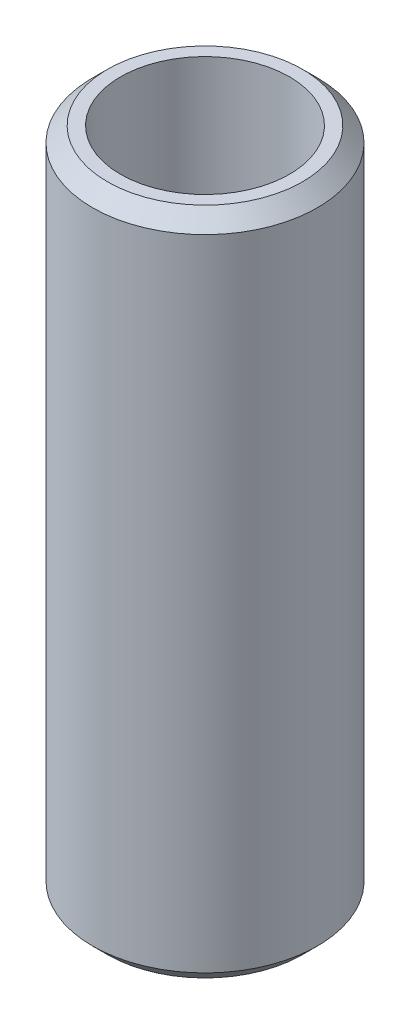
ISO-10303-21;
HEADER;
FILE_DESCRIPTION(('STEP AP214'),'2;1');
FILE_NAME('part.step','',(''),(''),'','','');
FILE_SCHEMA(('AUTOMOTIVE_DESIGN { 1 0 10303 214 1 1 1 1 }'));
ENDSEC;
DATA;
#1=APPLICATION_CONTEXT('core data for automotive mechanical design processes');
#2=APPLICATION_PROTOCOL_DEFINITION('international standard','automotive_design',2000,#1);
#3=PRODUCT_CONTEXT('',#1,'mechanical');
#4=PRODUCT('Part','Part','',(#3));
#5=PRODUCT_RELATED_PRODUCT_CATEGORY('part','',(#4));
#6=PRODUCT_DEFINITION_FORMATION('','',#4);
#7=PRODUCT_DEFINITION_CONTEXT('part definition',#1,'design');
#8=PRODUCT_DEFINITION('design','',#6,#7);
#9=PRODUCT_DEFINITION_SHAPE('','',#8);
#10=(LENGTH_UNIT() NAMED_UNIT(*) SI_UNIT(.MILLI.,.METRE.));
#11=(NAMED_UNIT(*) PLANE_ANGLE_UNIT() SI_UNIT($,.RADIAN.));
#12=(NAMED_UNIT(*) SI_UNIT($,.STERADIAN.) SOLID_ANGLE_UNIT());
#13=UNCERTAINTY_MEASURE_WITH_UNIT(LENGTH_MEASURE(1.E-05),#10,'distance_accuracy_value','');
#14=(GEOMETRIC_REPRESENTATION_CONTEXT(3) GLOBAL_UNCERTAINTY_ASSIGNED_CONTEXT((#13)) GLOBAL_UNIT_ASSIGNED_CONTEXT((#10,
#11,#12)) REPRESENTATION_CONTEXT('',''));
#15=CARTESIAN_POINT('',(0.,0.,0.));
#16=DIRECTION('',(0.,0.,1.));
#17=DIRECTION('',(1.,0.,0.));
#18=AXIS2_PLACEMENT_3D('',#15,#16,#17);
#19=CARTESIAN_POINT('',(0.,208.298471464032,0.));
#20=DIRECTION('',(0.,-1.,0.));
#21=DIRECTION('',(0.,0.,-1.));
#22=AXIS2_PLACEMENT_3D('',#19,#20,#21);
#23=CYLINDRICAL_SURFACE('',#22,35.);
#24=CARTESIAN_POINT('',(0.,203.643226573095,0.));
#25=DIRECTION('',(0.,1.,0.));
#26=DIRECTION('',(0.,0.,1.));
#27=AXIS2_PLACEMENT_3D('',#24,#25,#26);
#28=CIRCLE('',#27,35.);
#29=CARTESIAN_POINT('',(0.,203.643226573095,35.));
#30=VERTEX_POINT('',#29);
#31=EDGE_CURVE('E50',#30,#30,#28,.F.);
#32=ORIENTED_EDGE('',*,*,#31,.T.);
#33=EDGE_LOOP('',(#32));
#34=FACE_BOUND('',#33,.T.);
#35=CARTESIAN_POINT('',(0.,4.65524489093683,0.));
#36=DIRECTION('',(0.,1.,0.));
#37=DIRECTION('',(0.,0.,1.));
#38=AXIS2_PLACEMENT_3D('',#35,#36,#37);
#39=CIRCLE('',#38,35.);
#40=CARTESIAN_POINT('',(0.,4.65524489093683,35.));
#41=VERTEX_POINT('',#40);
#42=EDGE_CURVE('E51',#41,#41,#39,.T.);
#43=ORIENTED_EDGE('',*,*,#42,.T.);
#44=EDGE_LOOP('',(#43));
#45=FACE_BOUND('',#44,.T.);
#46=ADVANCED_FACE('F39',(#34,#45),#23,.T.);
#47=CARTESIAN_POINT('',(0.,208.298471464032,0.));
#48=DIRECTION('',(0.,1.,0.));
#49=DIRECTION('',(0.,0.,1.));
#50=AXIS2_PLACEMENT_3D('',#47,#48,#49);
#51=PLANE('',#50);
#52=CARTESIAN_POINT('',(0.,208.298471464032,0.));
#53=DIRECTION('',(0.,1.,0.));
#54=DIRECTION('',(0.,0.,1.));
#55=AXIS2_PLACEMENT_3D('',#52,#53,#54);
#56=CIRCLE('',#55,30.3447551090632);
#57=CARTESIAN_POINT('',(0.,208.298471464032,30.3447551090632));
#58=VERTEX_POINT('',#57);
#59=EDGE_CURVE('E54',#58,#58,#56,.T.);
#60=ORIENTED_EDGE('',*,*,#59,.T.);
#61=EDGE_LOOP('',(#60));
#62=FACE_BOUND('',#61,.T.);
#63=CARTESIAN_POINT('',(0.,208.298471464032,0.));
#64=DIRECTION('',(0.,1.,0.));
#65=DIRECTION('',(0.,0.,1.));
#66=AXIS2_PLACEMENT_3D('',#63,#64,#65);
#67=CIRCLE('',#66,26.2993905384078);
#68=CARTESIAN_POINT('',(0.,208.298471464032,26.2993905384078));
#69=VERTEX_POINT('',#68);
#70=EDGE_CURVE('E58',#69,#69,#67,.T.);
#71=ORIENTED_EDGE('',*,*,#70,.F.);
#72=EDGE_LOOP('',(#71));
#73=FACE_BOUND('',#72,.T.);
#74=ADVANCED_FACE('F69',(#62,#73),#51,.T.);
#75=CARTESIAN_POINT('',(0.,0.,0.));
#76=DIRECTION('',(0.,1.,0.));
#77=DIRECTION('',(0.,0.,1.));
#78=AXIS2_PLACEMENT_3D('',#75,#76,#77);
#79=PLANE('',#78);
#80=CARTESIAN_POINT('',(0.,0.,0.));
#81=DIRECTION('',(0.,1.,0.));
#82=DIRECTION('',(0.,0.,1.));
#83=AXIS2_PLACEMENT_3D('',#80,#81,#82);
#84=CIRCLE('',#83,30.3447551090631);
#85=CARTESIAN_POINT('',(0.,0.,30.3447551090631));
#86=VERTEX_POINT('',#85);
#87=EDGE_CURVE('E10',#86,#86,#84,.F.);
#88=ORIENTED_EDGE('',*,*,#87,.T.);
#89=EDGE_LOOP('',(#88));
#90=FACE_BOUND('',#89,.T.);
#91=CARTESIAN_POINT('',(0.,0.,0.));
#92=DIRECTION('',(0.,1.,0.));
#93=DIRECTION('',(0.,0.,1.));
#94=AXIS2_PLACEMENT_3D('',#91,#92,#93);
#95=CIRCLE('',#94,26.2993905384078);
#96=CARTESIAN_POINT('',(0.,0.,26.2993905384078));
#97=VERTEX_POINT('',#96);
#98=EDGE_CURVE('E63',#97,#97,#95,.T.);
#99=ORIENTED_EDGE('',*,*,#98,.T.);
#100=EDGE_LOOP('',(#99));
#101=FACE_BOUND('',#100,.T.);
#102=ADVANCED_FACE('F75',(#90,#101),#79,.F.);
#103=CARTESIAN_POINT('',(0.,208.298471464032,0.));
#104=DIRECTION('',(0.,-1.,0.));
#105=DIRECTION('',(0.,0.,-1.));
#106=AXIS2_PLACEMENT_3D('',#103,#104,#105);
#107=CYLINDRICAL_SURFACE('',#106,26.2993905384078);
#108=ORIENTED_EDGE('',*,*,#70,.T.);
#109=EDGE_LOOP('',(#108));
#110=FACE_BOUND('',#109,.T.);
#111=ORIENTED_EDGE('',*,*,#98,.F.);
#112=EDGE_LOOP('',(#111));
#113=FACE_BOUND('',#112,.T.);
#114=ADVANCED_FACE('F70',(#110,#113),#107,.F.);
#115=CARTESIAN_POINT('',(0.,208.298471464032,0.));
#116=DIRECTION('',(0.,-1.,0.));
#117=DIRECTION('',(0.,0.,-1.));
#118=AXIS2_PLACEMENT_3D('',#115,#116,#117);
#119=CONICAL_SURFACE('',#118,30.3447551090632,0.785398163397443);
#120=ORIENTED_EDGE('',*,*,#31,.F.);
#121=EDGE_LOOP('',(#120));
#122=FACE_BOUND('',#121,.T.);
#123=ORIENTED_EDGE('',*,*,#59,.F.);
#124=EDGE_LOOP('',(#123));
#125=FACE_BOUND('',#124,.T.);
#126=ADVANCED_FACE('F81',(#122,#125),#119,.T.);
#127=CARTESIAN_POINT('',(0.,4.65524489093683,0.));
#128=DIRECTION('',(0.,1.,0.));
#129=DIRECTION('',(0.,0.,1.));
#130=AXIS2_PLACEMENT_3D('',#127,#128,#129);
#131=CONICAL_SURFACE('',#130,35.,0.785398163397452);
#132=CARTESIAN_POINT('',(0.,0.,30.3447551090631));
#133=CARTESIAN_POINT('',(0.,0.0484921342805907,30.3932472433437));
#134=CARTESIAN_POINT('',(0.,0.0969842685611828,30.4417393776243));
#135=CARTESIAN_POINT('',(0.,0.193968537122367,30.5387236461855));
#136=CARTESIAN_POINT('',(0.,0.242460671402959,30.5872157804661));
#137=CARTESIAN_POINT('',(0.,0.339444939964143,30.6842000490273));
#138=CARTESIAN_POINT('',(0.,0.387937074244735,30.7326921833079));
#139=CARTESIAN_POINT('',(0.,0.484921342805918,30.8296764518691));
#140=CARTESIAN_POINT('',(0.,0.53341347708651,30.8781685861497));
#141=CARTESIAN_POINT('',(0.,0.630397745647695,30.9751528547108));
#142=CARTESIAN_POINT('',(0.,0.678889879928287,31.0236449889914));
#143=CARTESIAN_POINT('',(0.,0.77587414848947,31.1206292575526));
#144=CARTESIAN_POINT('',(0.,0.824366282770061,31.1691213918332));
#145=CARTESIAN_POINT('',(0.,0.921350551331245,31.2661056603944));
#146=CARTESIAN_POINT('',(0.,0.969842685611838,31.314597794675));
#147=CARTESIAN_POINT('',(0.,1.06682695417302,31.4115820632362));
#148=CARTESIAN_POINT('',(0.,1.11531908845361,31.4600741975168));
#149=CARTESIAN_POINT('',(0.,1.2123033570148,31.557058466078));
#150=CARTESIAN_POINT('',(0.,1.26079549129539,31.6055506003586));
#151=CARTESIAN_POINT('',(0.,1.35777975985657,31.7025348689197));
#152=CARTESIAN_POINT('',(0.,1.40627189413717,31.7510270032003));
#153=CARTESIAN_POINT('',(0.,1.50325616269835,31.8480112717615));
#154=CARTESIAN_POINT('',(0.,1.55174829697894,31.8965034060421));
#155=CARTESIAN_POINT('',(0.,1.64873256554012,31.9934876746033));
#156=CARTESIAN_POINT('',(0.,1.69722469982072,32.0419798088839));
#157=CARTESIAN_POINT('',(0.,1.7942089683819,32.1389640774451));
#158=CARTESIAN_POINT('',(0.,1.84270110266249,32.1874562117257));
#159=CARTESIAN_POINT('',(0.,1.93968537122368,32.2844404802868));
#160=CARTESIAN_POINT('',(0.,1.98817750550427,32.3329326145674));
#161=CARTESIAN_POINT('',(0.,2.08516177406545,32.4299168831286));
#162=CARTESIAN_POINT('',(0.,2.13365390834604,32.4784090174092));
#163=CARTESIAN_POINT('',(0.,2.23063817690723,32.5753932859704));
#164=CARTESIAN_POINT('',(0.,2.27913031118782,32.623885420251));
#165=CARTESIAN_POINT('',(0.,2.37611457974901,32.7208696888122));
#166=CARTESIAN_POINT('',(0.,2.4246067140296,32.7693618230928));
#167=CARTESIAN_POINT('',(0.,2.52159098259078,32.8663460916539));
#168=CARTESIAN_POINT('',(0.,2.57008311687137,32.9148382259345));
#169=CARTESIAN_POINT('',(0.,2.66706738543256,33.0118224944957));
#170=CARTESIAN_POINT('',(0.,2.71555951971315,33.0603146287763));
#171=CARTESIAN_POINT('',(0.,2.81254378827433,33.1572988973375));
#172=CARTESIAN_POINT('',(0.,2.86103592255492,33.2057910316181));
#173=CARTESIAN_POINT('',(0.,2.95802019111611,33.3027753001793));
#174=CARTESIAN_POINT('',(0.,3.0065123253967,33.3512674344599));
#175=CARTESIAN_POINT('',(0.,3.10349659395788,33.4482517030211));
#176=CARTESIAN_POINT('',(0.,3.15198872823848,33.4967438373017));
#177=CARTESIAN_POINT('',(0.,3.24897299679966,33.5937281058628));
#178=CARTESIAN_POINT('',(0.,3.29746513108025,33.6422202401434));
#179=CARTESIAN_POINT('',(0.,3.39444939964144,33.7392045087046));
#180=CARTESIAN_POINT('',(0.,3.44294153392203,33.7876966429852));
#181=CARTESIAN_POINT('',(0.,3.53992580248321,33.8846809115464));
#182=CARTESIAN_POINT('',(0.,3.5884179367638,33.933173045827));
#183=CARTESIAN_POINT('',(0.,3.68540220532499,34.0301573143882));
#184=CARTESIAN_POINT('',(0.,3.73389433960558,34.0786494486688));
#185=CARTESIAN_POINT('',(0.,3.83087860816676,34.1756337172299));
#186=CARTESIAN_POINT('',(0.,3.87937074244735,34.2241258515105));
#187=CARTESIAN_POINT('',(0.,3.97635501100854,34.3211101200717));
#188=CARTESIAN_POINT('',(0.,4.02484714528913,34.3696022543523));
#189=CARTESIAN_POINT('',(0.,4.12183141385032,34.4665865229135));
#190=CARTESIAN_POINT('',(0.,4.17032354813091,34.5150786571941));
#191=CARTESIAN_POINT('',(0.,4.26730781669209,34.6120629257553));
#192=CARTESIAN_POINT('',(0.,4.31579995097268,34.6605550600359));
#193=CARTESIAN_POINT('',(0.,4.41278421953387,34.757539328597));
#194=CARTESIAN_POINT('',(0.,4.46127635381446,34.8060314628776));
#195=CARTESIAN_POINT('',(0.,4.55826062237564,34.9030157314388));
#196=CARTESIAN_POINT('',(0.,4.60675275665624,34.9515078657194));
#197=CARTESIAN_POINT('',(0.,4.65524489093683,35.));
#198=B_SPLINE_CURVE_WITH_KNOTS('',3,(#132,#133,#134,#135,#136,#137,#138,#139,#140,#141,#142,
#143,#144,#145,#146,#147,#148,#149,#150,#151,#152,#153,#154,#155,#156,#157,#158,#159,#160,#161,
#162,#163,#164,#165,#166,#167,#168,#169,#170,#171,#172,#173,#174,#175,#176,#177,#178,#179,#180,
#181,#182,#183,#184,#185,#186,#187,#188,#189,#190,#191,#192,#193,#194,#195,#196,#197),
.UNSPECIFIED.,.F.,.F.,(4,2,2,2,2,2,2,2,2,2,2,2,2,2,2,2,2,2,2,2,2,2,2,2,2,2,2,2,2,2,2,2,4),(0.,
0.205734701904091,0.411469403808182,0.617204105712276,0.822938807616368,1.02867350952046,
1.23440821142455,1.44014291332864,1.64587761523273,1.85161231713683,2.05734701904092,
2.26308172094501,2.4688164228491,2.67455112475319,2.88028582665729,3.08602052856138,
3.29175523046547,3.49748993236956,3.70322463427366,3.90895933617775,4.11469403808184,
4.32042873998593,4.52616344189002,4.73189814379412,4.93763284569821,5.1433675476023,
5.34910224950639,5.55483695141049,5.76057165331458,5.96630635521867,6.17204105712276,
6.37777575902685,6.58351046093095),.UNSPECIFIED.);
#199=EDGE_CURVE('BSEAM45',#86,#41,#198,.T.);
#200=ORIENTED_EDGE('',*,*,#87,.F.);
#201=ORIENTED_EDGE('',*,*,#42,.F.);
#202=ORIENTED_EDGE('',*,*,#199,.T.);
#203=ORIENTED_EDGE('',*,*,#199,.F.);
#204=EDGE_LOOP('',(#200,#202,#201,#203));
#205=FACE_BOUND('',#204,.T.);
#206=ADVANCED_FACE('F45',(#205),#131,.T.);
#207=CLOSED_SHELL('',(#46,#74,#102,#114,#126,#206));
#208=MANIFOLD_SOLID_BREP('B2',#207);
#209=ADVANCED_BREP_SHAPE_REPRESENTATION('',(#18,#208),#14);
#210=SHAPE_DEFINITION_REPRESENTATION(#9,#209);
ENDSEC;
END-ISO-10303-21;
